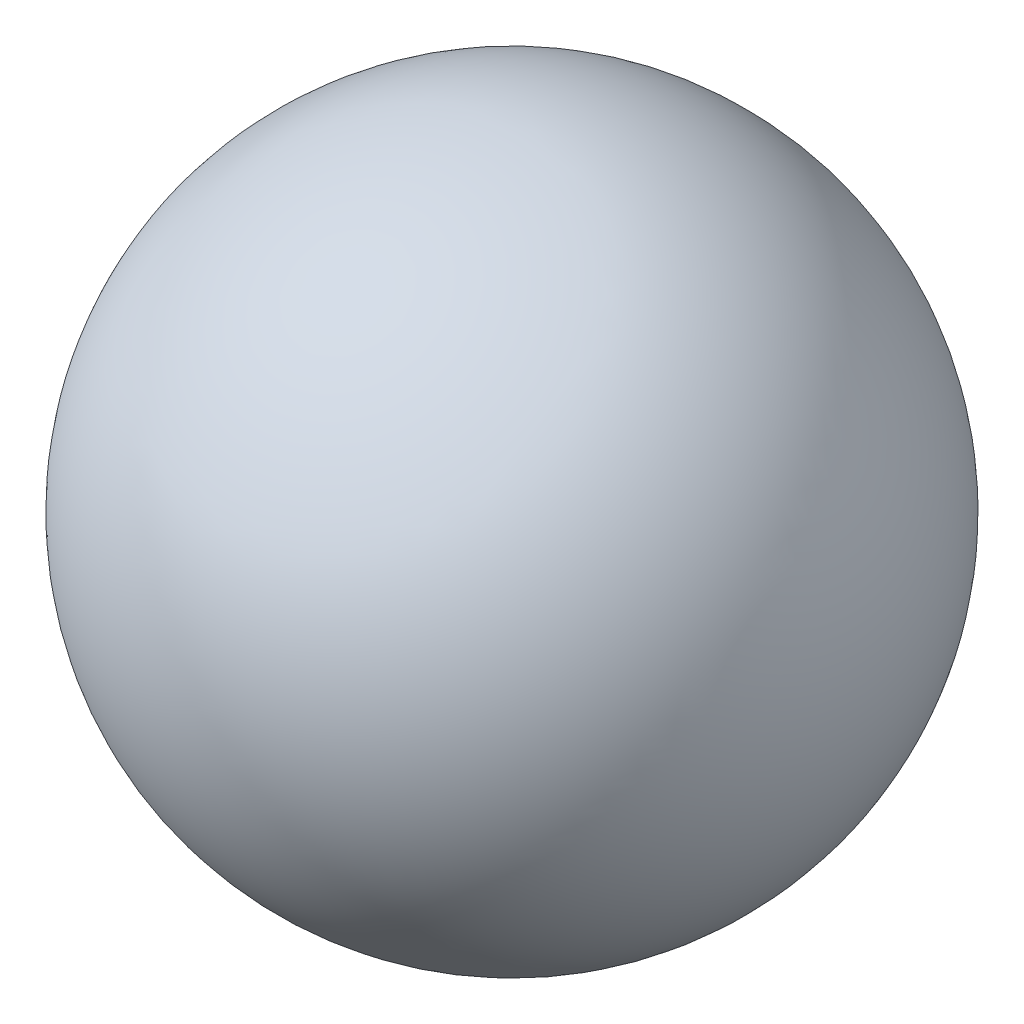
ISO-10303-21;
HEADER;
FILE_DESCRIPTION(('STEP AP214'),'2;1');
FILE_NAME('part.step','',(''),(''),'','','');
FILE_SCHEMA(('AUTOMOTIVE_DESIGN { 1 0 10303 214 1 1 1 1 }'));
ENDSEC;
DATA;
#1=APPLICATION_CONTEXT('core data for automotive mechanical design processes');
#2=APPLICATION_PROTOCOL_DEFINITION('international standard','automotive_design',2000,#1);
#3=PRODUCT_CONTEXT('',#1,'mechanical');
#4=PRODUCT('Part','Part','',(#3));
#5=PRODUCT_RELATED_PRODUCT_CATEGORY('part','',(#4));
#6=PRODUCT_DEFINITION_FORMATION('','',#4);
#7=PRODUCT_DEFINITION_CONTEXT('part definition',#1,'design');
#8=PRODUCT_DEFINITION('design','',#6,#7);
#9=PRODUCT_DEFINITION_SHAPE('','',#8);
#10=(LENGTH_UNIT() NAMED_UNIT(*) SI_UNIT(.MILLI.,.METRE.));
#11=(NAMED_UNIT(*) PLANE_ANGLE_UNIT() SI_UNIT($,.RADIAN.));
#12=(NAMED_UNIT(*) SI_UNIT($,.STERADIAN.) SOLID_ANGLE_UNIT());
#13=UNCERTAINTY_MEASURE_WITH_UNIT(LENGTH_MEASURE(1.E-05),#10,'distance_accuracy_value','');
#14=(GEOMETRIC_REPRESENTATION_CONTEXT(3) GLOBAL_UNCERTAINTY_ASSIGNED_CONTEXT((#13)) GLOBAL_UNIT_ASSIGNED_CONTEXT((#10,
#11,#12)) REPRESENTATION_CONTEXT('',''));
#15=CARTESIAN_POINT('',(0.,0.,0.));
#16=DIRECTION('',(0.,0.,1.));
#17=DIRECTION('',(1.,0.,0.));
#18=AXIS2_PLACEMENT_3D('',#15,#16,#17);
#19=CARTESIAN_POINT('',(0.,0.,0.));
#20=DIRECTION('',(-1.,0.,0.));
#21=DIRECTION('',(0.,1.,0.));
#22=AXIS2_PLACEMENT_3D('',#19,#20,#21);
#23=SPHERICAL_SURFACE('',#22,4.23333333333333);
#24=CARTESIAN_POINT('',(-4.23333333333333,0.,0.));
#25=VERTEX_POINT('',#24);
#26=VERTEX_LOOP('',#25);
#27=FACE_BOUND('',#26,.T.);
#28=ADVANCED_FACE('F33',(#27),#23,.T.);
#29=CLOSED_SHELL('',(#28));
#30=MANIFOLD_SOLID_BREP('B2',#29);
#31=ADVANCED_BREP_SHAPE_REPRESENTATION('',(#18,#30),#14);
#32=SHAPE_DEFINITION_REPRESENTATION(#9,#31);
ENDSEC;
END-ISO-10303-21;
